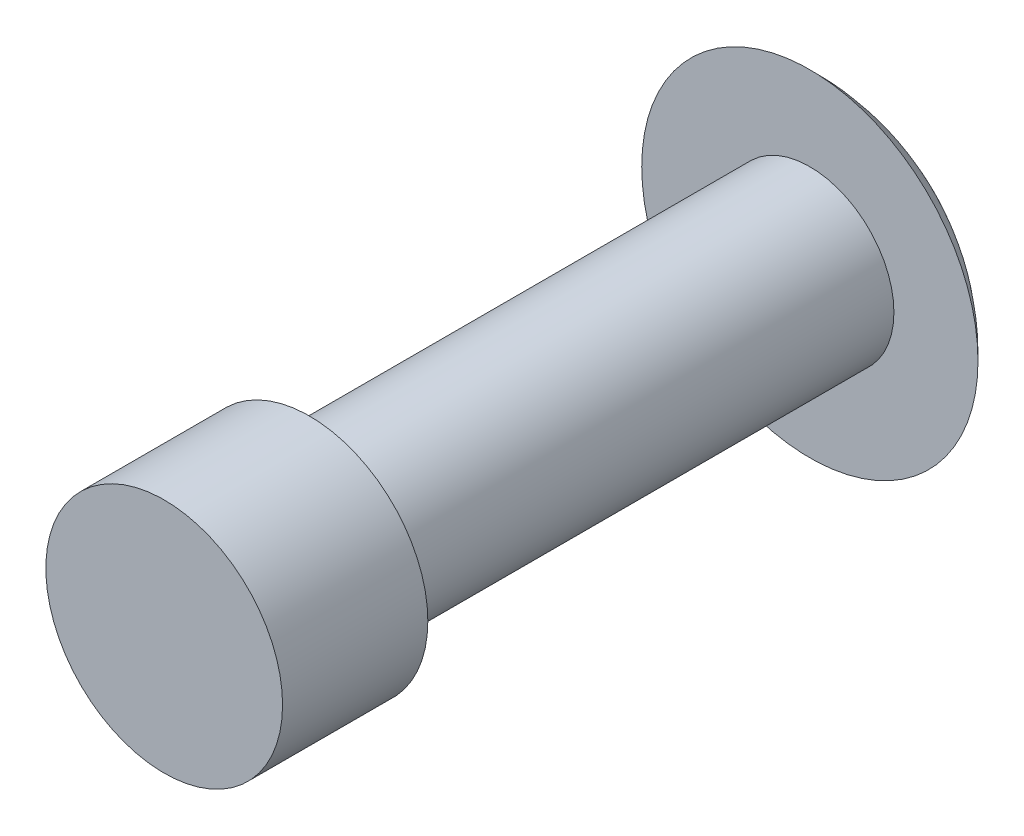
ISO-10303-21;
HEADER;
FILE_DESCRIPTION(('STEP AP214'),'2;1');
FILE_NAME('part.step','',(''),(''),'','','');
FILE_SCHEMA(('AUTOMOTIVE_DESIGN { 1 0 10303 214 1 1 1 1 }'));
ENDSEC;
DATA;
#1=APPLICATION_CONTEXT('core data for automotive mechanical design processes');
#2=APPLICATION_PROTOCOL_DEFINITION('international standard','automotive_design',2000,#1);
#3=PRODUCT_CONTEXT('',#1,'mechanical');
#4=PRODUCT('Part','Part','',(#3));
#5=PRODUCT_RELATED_PRODUCT_CATEGORY('part','',(#4));
#6=PRODUCT_DEFINITION_FORMATION('','',#4);
#7=PRODUCT_DEFINITION_CONTEXT('part definition',#1,'design');
#8=PRODUCT_DEFINITION('design','',#6,#7);
#9=PRODUCT_DEFINITION_SHAPE('','',#8);
#10=(LENGTH_UNIT() NAMED_UNIT(*) SI_UNIT(.MILLI.,.METRE.));
#11=(NAMED_UNIT(*) PLANE_ANGLE_UNIT() SI_UNIT($,.RADIAN.));
#12=(NAMED_UNIT(*) SI_UNIT($,.STERADIAN.) SOLID_ANGLE_UNIT());
#13=UNCERTAINTY_MEASURE_WITH_UNIT(LENGTH_MEASURE(1.E-05),#10,'distance_accuracy_value','');
#14=(GEOMETRIC_REPRESENTATION_CONTEXT(3) GLOBAL_UNCERTAINTY_ASSIGNED_CONTEXT((#13)) GLOBAL_UNIT_ASSIGNED_CONTEXT((#10,
#11,#12)) REPRESENTATION_CONTEXT('',''));
#15=CARTESIAN_POINT('',(0.,0.,0.));
#16=DIRECTION('',(0.,0.,1.));
#17=DIRECTION('',(1.,0.,0.));
#18=AXIS2_PLACEMENT_3D('',#15,#16,#17);
#19=CARTESIAN_POINT('',(0.,0.,15.24));
#20=DIRECTION('',(0.,0.,-1.));
#21=DIRECTION('',(-1.,0.,0.));
#22=AXIS2_PLACEMENT_3D('',#19,#20,#21);
#23=CYLINDRICAL_SURFACE('',#22,1.984375);
#24=CARTESIAN_POINT('',(0.,0.,0.));
#25=DIRECTION('',(0.,0.,1.));
#26=DIRECTION('',(1.,0.,0.));
#27=AXIS2_PLACEMENT_3D('',#24,#25,#26);
#28=CIRCLE('',#27,1.984375);
#29=CARTESIAN_POINT('',(1.984375,0.,0.));
#30=VERTEX_POINT('',#29);
#31=EDGE_CURVE('E37',#30,#30,#28,.T.);
#32=ORIENTED_EDGE('',*,*,#31,.T.);
#33=EDGE_LOOP('',(#32));
#34=FACE_BOUND('',#33,.T.);
#35=CARTESIAN_POINT('',(0.,0.,11.811));
#36=DIRECTION('',(0.,0.,1.));
#37=DIRECTION('',(1.,0.,0.));
#38=AXIS2_PLACEMENT_3D('',#35,#36,#37);
#39=CIRCLE('',#38,1.984375);
#40=CARTESIAN_POINT('',(1.984375,0.,11.811));
#41=VERTEX_POINT('',#40);
#42=EDGE_CURVE('E12',#41,#41,#39,.T.);
#43=ORIENTED_EDGE('',*,*,#42,.F.);
#44=EDGE_LOOP('',(#43));
#45=FACE_BOUND('',#44,.T.);
#46=ADVANCED_FACE('F31',(#34,#45),#23,.T.);
#47=CARTESIAN_POINT('',(0.,0.,0.));
#48=DIRECTION('',(0.,0.,1.));
#49=DIRECTION('',(1.,0.,0.));
#50=AXIS2_PLACEMENT_3D('',#47,#48,#49);
#51=PLANE('',#50);
#52=CARTESIAN_POINT('',(0.,0.,0.));
#53=DIRECTION('',(0.,0.,1.));
#54=DIRECTION('',(1.,0.,0.));
#55=AXIS2_PLACEMENT_3D('',#52,#53,#54);
#56=CIRCLE('',#55,3.96875);
#57=CARTESIAN_POINT('',(3.96875,0.,0.));
#58=VERTEX_POINT('',#57);
#59=EDGE_CURVE('E41',#58,#58,#56,.T.);
#60=ORIENTED_EDGE('',*,*,#59,.T.);
#61=EDGE_LOOP('',(#60));
#62=FACE_BOUND('',#61,.T.);
#63=ORIENTED_EDGE('',*,*,#31,.F.);
#64=EDGE_LOOP('',(#63));
#65=FACE_BOUND('',#64,.T.);
#66=ADVANCED_FACE('F71',(#62,#65),#51,.T.);
#67=CARTESIAN_POINT('',(0.,0.,3.77684020522388));
#68=DIRECTION('',(0.,0.,1.));
#69=DIRECTION('',(1.,0.,0.));
#70=AXIS2_PLACEMENT_3D('',#67,#68,#69);
#71=SPHERICAL_SURFACE('',#70,5.47864020522388);
#72=ORIENTED_EDGE('',*,*,#59,.F.);
#73=EDGE_LOOP('',(#72));
#74=FACE_BOUND('',#73,.T.);
#75=ADVANCED_FACE('F65',(#74),#71,.T.);
#76=CARTESIAN_POINT('',(0.,0.,11.811));
#77=DIRECTION('',(0.,0.,1.));
#78=DIRECTION('',(1.,0.,0.));
#79=AXIS2_PLACEMENT_3D('',#76,#77,#78);
#80=PLANE('',#79);
#81=CARTESIAN_POINT('',(0.,0.,11.811));
#82=DIRECTION('',(0.,0.,1.));
#83=DIRECTION('',(1.,0.,0.));
#84=AXIS2_PLACEMENT_3D('',#81,#82,#83);
#85=CIRCLE('',#84,2.794);
#86=CARTESIAN_POINT('',(2.794,0.,11.811));
#87=VERTEX_POINT('',#86);
#88=EDGE_CURVE('E45',#87,#87,#85,.F.);
#89=ORIENTED_EDGE('',*,*,#88,.T.);
#90=EDGE_LOOP('',(#89));
#91=FACE_BOUND('',#90,.T.);
#92=ORIENTED_EDGE('',*,*,#42,.T.);
#93=EDGE_LOOP('',(#92));
#94=FACE_BOUND('',#93,.T.);
#95=ADVANCED_FACE('F58',(#91,#94),#80,.F.);
#96=CARTESIAN_POINT('',(0.,0.,-7.90262538654086));
#97=DIRECTION('',(0.,0.,1.));
#98=DIRECTION('',(1.,0.,0.));
#99=AXIS2_PLACEMENT_3D('',#96,#97,#98);
#100=CYLINDRICAL_SURFACE('',#99,2.794);
#101=ORIENTED_EDGE('',*,*,#88,.F.);
#102=EDGE_LOOP('',(#101));
#103=FACE_BOUND('',#102,.T.);
#104=CARTESIAN_POINT('',(0.,0.,15.24));
#105=DIRECTION('',(0.,0.,1.));
#106=DIRECTION('',(1.,0.,0.));
#107=AXIS2_PLACEMENT_3D('',#104,#105,#106);
#108=CIRCLE('',#107,2.794);
#109=CARTESIAN_POINT('',(2.794,0.,15.24));
#110=VERTEX_POINT('',#109);
#111=EDGE_CURVE('E50',#110,#110,#108,.T.);
#112=ORIENTED_EDGE('',*,*,#111,.F.);
#113=EDGE_LOOP('',(#112));
#114=FACE_BOUND('',#113,.T.);
#115=ADVANCED_FACE('F56',(#103,#114),#100,.T.);
#116=CARTESIAN_POINT('',(0.,0.,15.24));
#117=DIRECTION('',(0.,0.,1.));
#118=DIRECTION('',(1.,0.,0.));
#119=AXIS2_PLACEMENT_3D('',#116,#117,#118);
#120=PLANE('',#119);
#121=ORIENTED_EDGE('',*,*,#111,.T.);
#122=EDGE_LOOP('',(#121));
#123=FACE_BOUND('',#122,.T.);
#124=ADVANCED_FACE('F54',(#123),#120,.T.);
#125=CLOSED_SHELL('',(#46,#66,#75,#95,#115,#124));
#126=MANIFOLD_SOLID_BREP('B2',#125);
#127=ADVANCED_BREP_SHAPE_REPRESENTATION('',(#18,#126),#14);
#128=SHAPE_DEFINITION_REPRESENTATION(#9,#127);
ENDSEC;
END-ISO-10303-21;
